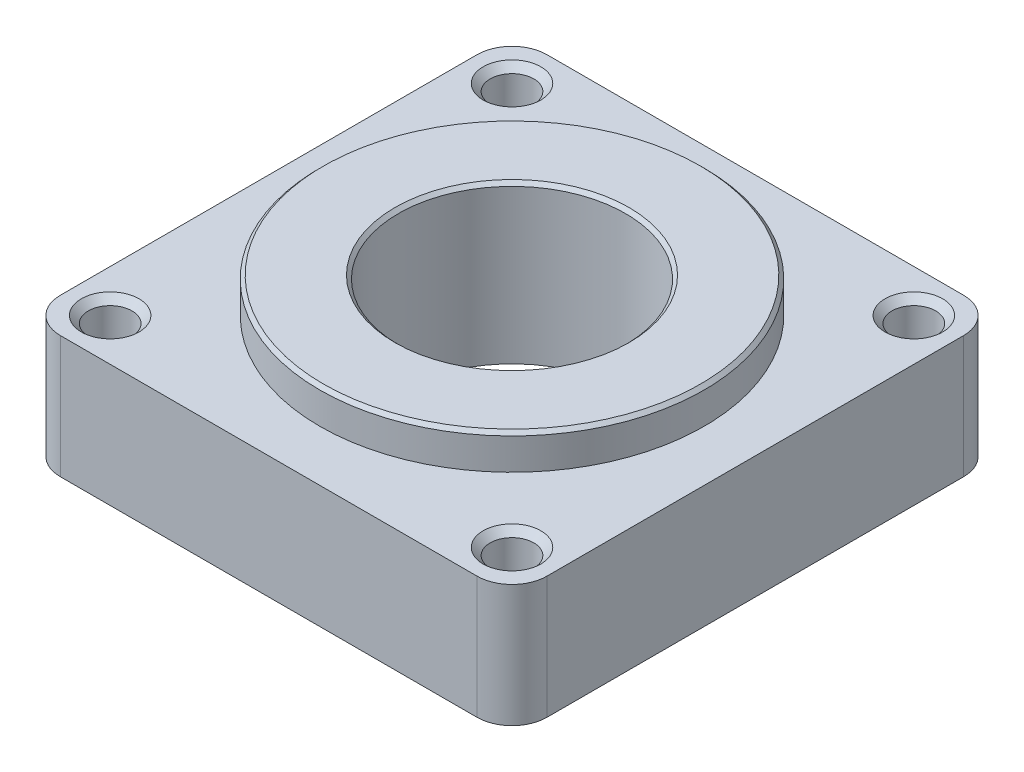
ISO-10303-21;
HEADER;
FILE_DESCRIPTION(('STEP AP214'),'2;1');
FILE_NAME('part.step','',(''),(''),'','','');
FILE_SCHEMA(('AUTOMOTIVE_DESIGN { 1 0 10303 214 1 1 1 1 }'));
ENDSEC;
DATA;
#1=APPLICATION_CONTEXT('core data for automotive mechanical design processes');
#2=APPLICATION_PROTOCOL_DEFINITION('international standard','automotive_design',2000,#1);
#3=PRODUCT_CONTEXT('',#1,'mechanical');
#4=PRODUCT('Part','Part','',(#3));
#5=PRODUCT_RELATED_PRODUCT_CATEGORY('part','',(#4));
#6=PRODUCT_DEFINITION_FORMATION('','',#4);
#7=PRODUCT_DEFINITION_CONTEXT('part definition',#1,'design');
#8=PRODUCT_DEFINITION('design','',#6,#7);
#9=PRODUCT_DEFINITION_SHAPE('','',#8);
#10=(LENGTH_UNIT() NAMED_UNIT(*) SI_UNIT(.MILLI.,.METRE.));
#11=(NAMED_UNIT(*) PLANE_ANGLE_UNIT() SI_UNIT($,.RADIAN.));
#12=(NAMED_UNIT(*) SI_UNIT($,.STERADIAN.) SOLID_ANGLE_UNIT());
#13=UNCERTAINTY_MEASURE_WITH_UNIT(LENGTH_MEASURE(1.E-05),#10,'distance_accuracy_value','');
#14=(GEOMETRIC_REPRESENTATION_CONTEXT(3) GLOBAL_UNCERTAINTY_ASSIGNED_CONTEXT((#13)) GLOBAL_UNIT_ASSIGNED_CONTEXT((#10,
#11,#12)) REPRESENTATION_CONTEXT('',''));
#15=CARTESIAN_POINT('',(0.,0.,0.));
#16=DIRECTION('',(0.,0.,1.));
#17=DIRECTION('',(1.,0.,0.));
#18=AXIS2_PLACEMENT_3D('',#15,#16,#17);
#19=CARTESIAN_POINT('',(0.,7.,0.));
#20=DIRECTION('',(0.,1.,0.));
#21=DIRECTION('',(0.,0.,1.));
#22=AXIS2_PLACEMENT_3D('',#19,#20,#21);
#23=PLANE('',#22);
#24=CARTESIAN_POINT('',(11.5,7.,-11.5));
#25=DIRECTION('',(0.,1.,0.));
#26=DIRECTION('',(0.,0.,1.));
#27=AXIS2_PLACEMENT_3D('',#24,#25,#26);
#28=CIRCLE('',#27,1.65);
#29=CARTESIAN_POINT('',(11.5,7.,-9.85));
#30=VERTEX_POINT('',#29);
#31=EDGE_CURVE('E203',#30,#30,#28,.F.);
#32=ORIENTED_EDGE('',*,*,#31,.T.);
#33=EDGE_LOOP('',(#32));
#34=FACE_BOUND('',#33,.T.);
#35=CARTESIAN_POINT('',(-11.5,7.,-11.5));
#36=DIRECTION('',(0.,1.,0.));
#37=DIRECTION('',(0.,0.,1.));
#38=AXIS2_PLACEMENT_3D('',#35,#36,#37);
#39=CIRCLE('',#38,1.65);
#40=CARTESIAN_POINT('',(-11.5,7.,-9.85));
#41=VERTEX_POINT('',#40);
#42=EDGE_CURVE('E200',#41,#41,#39,.F.);
#43=ORIENTED_EDGE('',*,*,#42,.T.);
#44=EDGE_LOOP('',(#43));
#45=FACE_BOUND('',#44,.T.);
#46=CARTESIAN_POINT('',(11.5,7.,11.5));
#47=DIRECTION('',(0.,1.,0.));
#48=DIRECTION('',(0.,0.,1.));
#49=AXIS2_PLACEMENT_3D('',#46,#47,#48);
#50=CIRCLE('',#49,1.65);
#51=CARTESIAN_POINT('',(11.5,7.,13.15));
#52=VERTEX_POINT('',#51);
#53=EDGE_CURVE('E197',#52,#52,#50,.F.);
#54=ORIENTED_EDGE('',*,*,#53,.T.);
#55=EDGE_LOOP('',(#54));
#56=FACE_BOUND('',#55,.T.);
#57=CARTESIAN_POINT('',(-11.5,7.,11.5));
#58=DIRECTION('',(0.,1.,0.));
#59=DIRECTION('',(0.,0.,1.));
#60=AXIS2_PLACEMENT_3D('',#57,#58,#59);
#61=CIRCLE('',#60,1.65);
#62=CARTESIAN_POINT('',(-11.5,7.,13.15));
#63=VERTEX_POINT('',#62);
#64=EDGE_CURVE('E194',#63,#63,#61,.F.);
#65=ORIENTED_EDGE('',*,*,#64,.T.);
#66=EDGE_LOOP('',(#65));
#67=FACE_BOUND('',#66,.T.);
#68=DIRECTION('',(0.,0.,1.));
#69=VECTOR('',#68,1.);
#70=CARTESIAN_POINT('',(-13.925,7.,0.));
#71=LINE('',#70,#69);
#72=CARTESIAN_POINT('',(-13.925,7.,-11.925));
#73=VERTEX_POINT('',#72);
#74=CARTESIAN_POINT('',(-13.925,7.,11.925));
#75=VERTEX_POINT('',#74);
#76=EDGE_CURVE('E162',#73,#75,#71,.T.);
#77=ORIENTED_EDGE('',*,*,#76,.T.);
#78=CARTESIAN_POINT('',(-11.925,7.,11.925));
#79=DIRECTION('',(0.,1.,0.));
#80=DIRECTION('',(0.,0.,1.));
#81=AXIS2_PLACEMENT_3D('',#78,#79,#80);
#82=CIRCLE('',#81,2.);
#83=CARTESIAN_POINT('',(-11.925,7.,13.925));
#84=VERTEX_POINT('',#83);
#85=EDGE_CURVE('E149',#75,#84,#82,.T.);
#86=ORIENTED_EDGE('',*,*,#85,.T.);
#87=DIRECTION('',(-1.,0.,0.));
#88=VECTOR('',#87,1.);
#89=CARTESIAN_POINT('',(0.,7.,13.925));
#90=LINE('',#89,#88);
#91=CARTESIAN_POINT('',(11.925,7.,13.925));
#92=VERTEX_POINT('',#91);
#93=EDGE_CURVE('E160',#92,#84,#90,.T.);
#94=ORIENTED_EDGE('',*,*,#93,.F.);
#95=CARTESIAN_POINT('',(11.925,7.,11.925));
#96=DIRECTION('',(0.,1.,0.));
#97=DIRECTION('',(0.,0.,1.));
#98=AXIS2_PLACEMENT_3D('',#95,#96,#97);
#99=CIRCLE('',#98,2.);
#100=CARTESIAN_POINT('',(13.925,7.,11.925));
#101=VERTEX_POINT('',#100);
#102=EDGE_CURVE('E126',#92,#101,#99,.T.);
#103=ORIENTED_EDGE('',*,*,#102,.T.);
#104=DIRECTION('',(0.,0.,1.));
#105=VECTOR('',#104,1.);
#106=CARTESIAN_POINT('',(13.925,7.,0.));
#107=LINE('',#106,#105);
#108=CARTESIAN_POINT('',(13.925,7.,-11.925));
#109=VERTEX_POINT('',#108);
#110=EDGE_CURVE('E158',#109,#101,#107,.T.);
#111=ORIENTED_EDGE('',*,*,#110,.F.);
#112=CARTESIAN_POINT('',(11.925,7.,-11.925));
#113=DIRECTION('',(0.,1.,0.));
#114=DIRECTION('',(0.,0.,1.));
#115=AXIS2_PLACEMENT_3D('',#112,#113,#114);
#116=CIRCLE('',#115,2.);
#117=CARTESIAN_POINT('',(11.925,7.,-13.925));
#118=VERTEX_POINT('',#117);
#119=EDGE_CURVE('E51',#109,#118,#116,.T.);
#120=ORIENTED_EDGE('',*,*,#119,.T.);
#121=DIRECTION('',(1.,0.,0.));
#122=VECTOR('',#121,1.);
#123=CARTESIAN_POINT('',(0.,7.,-13.925));
#124=LINE('',#123,#122);
#125=CARTESIAN_POINT('',(-11.925,7.,-13.925));
#126=VERTEX_POINT('',#125);
#127=EDGE_CURVE('E159',#126,#118,#124,.T.);
#128=ORIENTED_EDGE('',*,*,#127,.F.);
#129=CARTESIAN_POINT('',(-11.925,7.,-11.925));
#130=DIRECTION('',(0.,1.,0.));
#131=DIRECTION('',(0.,0.,1.));
#132=AXIS2_PLACEMENT_3D('',#129,#130,#131);
#133=CIRCLE('',#132,2.);
#134=EDGE_CURVE('E147',#126,#73,#133,.T.);
#135=ORIENTED_EDGE('',*,*,#134,.T.);
#136=EDGE_LOOP('',(#77,#86,#94,#103,#111,#120,#128,#135));
#137=FACE_BOUND('',#136,.T.);
#138=CARTESIAN_POINT('',(0.,7.,0.));
#139=DIRECTION('',(0.,1.,0.));
#140=DIRECTION('',(0.,0.,1.));
#141=AXIS2_PLACEMENT_3D('',#138,#139,#140);
#142=CIRCLE('',#141,11.);
#143=CARTESIAN_POINT('',(0.,7.,11.));
#144=VERTEX_POINT('',#143);
#145=EDGE_CURVE('E175',#144,#144,#142,.F.);
#146=ORIENTED_EDGE('',*,*,#145,.T.);
#147=EDGE_LOOP('',(#146));
#148=FACE_BOUND('',#147,.T.);
#149=ADVANCED_FACE('F36',(#34,#45,#56,#67,#137,#148),#23,.T.);
#150=CARTESIAN_POINT('',(0.,7.,13.925));
#151=DIRECTION('',(0.,0.,1.));
#152=DIRECTION('',(1.,0.,0.));
#153=AXIS2_PLACEMENT_3D('',#150,#151,#152);
#154=PLANE('',#153);
#155=ORIENTED_EDGE('',*,*,#93,.T.);
#156=DIRECTION('',(0.,-1.,0.));
#157=VECTOR('',#156,1.);
#158=CARTESIAN_POINT('',(-11.925,0.,13.925));
#159=LINE('',#158,#157);
#160=CARTESIAN_POINT('',(-11.925,0.,13.925));
#161=VERTEX_POINT('',#160);
#162=EDGE_CURVE('E114',#84,#161,#159,.T.);
#163=ORIENTED_EDGE('',*,*,#162,.T.);
#164=DIRECTION('',(-1.,0.,0.));
#165=VECTOR('',#164,1.);
#166=CARTESIAN_POINT('',(0.,0.,13.925));
#167=LINE('',#166,#165);
#168=CARTESIAN_POINT('',(11.925,0.,13.925));
#169=VERTEX_POINT('',#168);
#170=EDGE_CURVE('E106',#169,#161,#167,.T.);
#171=ORIENTED_EDGE('',*,*,#170,.F.);
#172=DIRECTION('',(0.,-1.,0.));
#173=VECTOR('',#172,1.);
#174=CARTESIAN_POINT('',(11.925,7.,13.925));
#175=LINE('',#174,#173);
#176=EDGE_CURVE('E120',#169,#92,#175,.F.);
#177=ORIENTED_EDGE('',*,*,#176,.T.);
#178=EDGE_LOOP('',(#155,#163,#171,#177));
#179=FACE_BOUND('',#178,.T.);
#180=ADVANCED_FACE('F119',(#179),#154,.T.);
#181=CARTESIAN_POINT('',(13.925,7.,0.));
#182=DIRECTION('',(1.,0.,0.));
#183=DIRECTION('',(0.,0.,-1.));
#184=AXIS2_PLACEMENT_3D('',#181,#182,#183);
#185=PLANE('',#184);
#186=DIRECTION('',(0.,0.,1.));
#187=VECTOR('',#186,1.);
#188=CARTESIAN_POINT('',(13.925,0.,0.));
#189=LINE('',#188,#187);
#190=CARTESIAN_POINT('',(13.925,0.,-11.925));
#191=VERTEX_POINT('',#190);
#192=CARTESIAN_POINT('',(13.925,0.,11.925));
#193=VERTEX_POINT('',#192);
#194=EDGE_CURVE('E108',#191,#193,#189,.T.);
#195=ORIENTED_EDGE('',*,*,#194,.F.);
#196=DIRECTION('',(0.,-1.,0.));
#197=VECTOR('',#196,1.);
#198=CARTESIAN_POINT('',(13.925,7.,-11.925));
#199=LINE('',#198,#197);
#200=EDGE_CURVE('E11',#191,#109,#199,.F.);
#201=ORIENTED_EDGE('',*,*,#200,.T.);
#202=ORIENTED_EDGE('',*,*,#110,.T.);
#203=DIRECTION('',(0.,-1.,0.));
#204=VECTOR('',#203,1.);
#205=CARTESIAN_POINT('',(13.925,7.,11.925));
#206=LINE('',#205,#204);
#207=EDGE_CURVE('E44',#101,#193,#206,.T.);
#208=ORIENTED_EDGE('',*,*,#207,.T.);
#209=EDGE_LOOP('',(#195,#201,#202,#208));
#210=FACE_BOUND('',#209,.T.);
#211=ADVANCED_FACE('F156',(#210),#185,.T.);
#212=CARTESIAN_POINT('',(0.,7.,-13.925));
#213=DIRECTION('',(0.,0.,-1.));
#214=DIRECTION('',(-1.,0.,0.));
#215=AXIS2_PLACEMENT_3D('',#212,#213,#214);
#216=PLANE('',#215);
#217=DIRECTION('',(1.,0.,0.));
#218=VECTOR('',#217,1.);
#219=CARTESIAN_POINT('',(0.,0.,-13.925));
#220=LINE('',#219,#218);
#221=CARTESIAN_POINT('',(-11.925,0.,-13.925));
#222=VERTEX_POINT('',#221);
#223=CARTESIAN_POINT('',(11.925,0.,-13.925));
#224=VERTEX_POINT('',#223);
#225=EDGE_CURVE('E184',#222,#224,#220,.T.);
#226=ORIENTED_EDGE('',*,*,#225,.F.);
#227=DIRECTION('',(0.,-1.,0.));
#228=VECTOR('',#227,1.);
#229=CARTESIAN_POINT('',(-11.925,7.,-13.925));
#230=LINE('',#229,#228);
#231=EDGE_CURVE('E58',#222,#126,#230,.F.);
#232=ORIENTED_EDGE('',*,*,#231,.T.);
#233=ORIENTED_EDGE('',*,*,#127,.T.);
#234=DIRECTION('',(0.,-1.,0.));
#235=VECTOR('',#234,1.);
#236=CARTESIAN_POINT('',(11.925,7.,-13.925));
#237=LINE('',#236,#235);
#238=EDGE_CURVE('E151',#118,#224,#237,.T.);
#239=ORIENTED_EDGE('',*,*,#238,.T.);
#240=EDGE_LOOP('',(#226,#232,#233,#239));
#241=FACE_BOUND('',#240,.T.);
#242=ADVANCED_FACE('F300',(#241),#216,.T.);
#243=CARTESIAN_POINT('',(-13.925,7.,0.));
#244=DIRECTION('',(1.,0.,0.));
#245=DIRECTION('',(0.,0.,-1.));
#246=AXIS2_PLACEMENT_3D('',#243,#244,#245);
#247=PLANE('',#246);
#248=DIRECTION('',(0.,0.,1.));
#249=VECTOR('',#248,1.);
#250=CARTESIAN_POINT('',(-13.925,0.,0.));
#251=LINE('',#250,#249);
#252=CARTESIAN_POINT('',(-13.925,0.,-11.925));
#253=VERTEX_POINT('',#252);
#254=CARTESIAN_POINT('',(-13.925,0.,11.925));
#255=VERTEX_POINT('',#254);
#256=EDGE_CURVE('E187',#253,#255,#251,.T.);
#257=ORIENTED_EDGE('',*,*,#256,.T.);
#258=DIRECTION('',(0.,-1.,0.));
#259=VECTOR('',#258,1.);
#260=CARTESIAN_POINT('',(-13.925,7.,11.925));
#261=LINE('',#260,#259);
#262=EDGE_CURVE('E143',#255,#75,#261,.F.);
#263=ORIENTED_EDGE('',*,*,#262,.T.);
#264=ORIENTED_EDGE('',*,*,#76,.F.);
#265=DIRECTION('',(0.,-1.,0.));
#266=VECTOR('',#265,1.);
#267=CARTESIAN_POINT('',(-13.925,0.,-11.925));
#268=LINE('',#267,#266);
#269=EDGE_CURVE('E140',#73,#253,#268,.T.);
#270=ORIENTED_EDGE('',*,*,#269,.T.);
#271=EDGE_LOOP('',(#257,#263,#264,#270));
#272=FACE_BOUND('',#271,.T.);
#273=ADVANCED_FACE('F306',(#272),#247,.F.);
#274=CARTESIAN_POINT('',(-11.5,7.,-11.5));
#275=DIRECTION('',(0.,-1.,0.));
#276=DIRECTION('',(0.,0.,-1.));
#277=AXIS2_PLACEMENT_3D('',#274,#275,#276);
#278=CYLINDRICAL_SURFACE('',#277,1.25);
#279=CARTESIAN_POINT('',(-11.5,6.6,-11.5));
#280=DIRECTION('',(0.,1.,0.));
#281=DIRECTION('',(0.,0.,1.));
#282=AXIS2_PLACEMENT_3D('',#279,#280,#281);
#283=CIRCLE('',#282,1.25);
#284=CARTESIAN_POINT('',(-11.5,6.6,-10.25));
#285=VERTEX_POINT('',#284);
#286=EDGE_CURVE('E206',#285,#285,#283,.T.);
#287=ORIENTED_EDGE('',*,*,#286,.T.);
#288=EDGE_LOOP('',(#287));
#289=FACE_BOUND('',#288,.T.);
#290=CARTESIAN_POINT('',(-11.5,0.,-11.5));
#291=DIRECTION('',(0.,1.,0.));
#292=DIRECTION('',(0.,0.,1.));
#293=AXIS2_PLACEMENT_3D('',#290,#291,#292);
#294=CIRCLE('',#293,1.25);
#295=CARTESIAN_POINT('',(-11.5,0.,-10.25));
#296=VERTEX_POINT('',#295);
#297=EDGE_CURVE('E123',#296,#296,#294,.T.);
#298=ORIENTED_EDGE('',*,*,#297,.F.);
#299=EDGE_LOOP('',(#298));
#300=FACE_BOUND('',#299,.T.);
#301=ADVANCED_FACE('F314',(#289,#300),#278,.F.);
#302=CARTESIAN_POINT('',(11.5,7.,-11.5));
#303=DIRECTION('',(0.,-1.,0.));
#304=DIRECTION('',(0.,0.,-1.));
#305=AXIS2_PLACEMENT_3D('',#302,#303,#304);
#306=CYLINDRICAL_SURFACE('',#305,1.25);
#307=CARTESIAN_POINT('',(11.5,6.6,-11.5));
#308=DIRECTION('',(0.,1.,0.));
#309=DIRECTION('',(0.,0.,1.));
#310=AXIS2_PLACEMENT_3D('',#307,#308,#309);
#311=CIRCLE('',#310,1.25);
#312=CARTESIAN_POINT('',(11.5,6.6,-10.25));
#313=VERTEX_POINT('',#312);
#314=EDGE_CURVE('E170',#313,#313,#311,.T.);
#315=ORIENTED_EDGE('',*,*,#314,.T.);
#316=EDGE_LOOP('',(#315));
#317=FACE_BOUND('',#316,.T.);
#318=CARTESIAN_POINT('',(11.5,0.,-11.5));
#319=DIRECTION('',(0.,1.,0.));
#320=DIRECTION('',(0.,0.,1.));
#321=AXIS2_PLACEMENT_3D('',#318,#319,#320);
#322=CIRCLE('',#321,1.25);
#323=CARTESIAN_POINT('',(11.5,0.,-10.25));
#324=VERTEX_POINT('',#323);
#325=EDGE_CURVE('E178',#324,#324,#322,.T.);
#326=ORIENTED_EDGE('',*,*,#325,.F.);
#327=EDGE_LOOP('',(#326));
#328=FACE_BOUND('',#327,.T.);
#329=ADVANCED_FACE('F320',(#317,#328),#306,.F.);
#330=CARTESIAN_POINT('',(-11.5,7.,11.5));
#331=DIRECTION('',(0.,-1.,0.));
#332=DIRECTION('',(0.,0.,-1.));
#333=AXIS2_PLACEMENT_3D('',#330,#331,#332);
#334=CYLINDRICAL_SURFACE('',#333,1.25);
#335=CARTESIAN_POINT('',(-11.5,6.6,11.5));
#336=DIRECTION('',(0.,1.,0.));
#337=DIRECTION('',(0.,0.,1.));
#338=AXIS2_PLACEMENT_3D('',#335,#336,#337);
#339=CIRCLE('',#338,1.25);
#340=CARTESIAN_POINT('',(-11.5,6.6,12.75));
#341=VERTEX_POINT('',#340);
#342=EDGE_CURVE('E212',#341,#341,#339,.T.);
#343=ORIENTED_EDGE('',*,*,#342,.T.);
#344=EDGE_LOOP('',(#343));
#345=FACE_BOUND('',#344,.T.);
#346=CARTESIAN_POINT('',(-11.5,0.,11.5));
#347=DIRECTION('',(0.,1.,0.));
#348=DIRECTION('',(0.,0.,1.));
#349=AXIS2_PLACEMENT_3D('',#346,#347,#348);
#350=CIRCLE('',#349,1.25);
#351=CARTESIAN_POINT('',(-11.5,0.,12.75));
#352=VERTEX_POINT('',#351);
#353=EDGE_CURVE('E174',#352,#352,#350,.T.);
#354=ORIENTED_EDGE('',*,*,#353,.F.);
#355=EDGE_LOOP('',(#354));
#356=FACE_BOUND('',#355,.T.);
#357=ADVANCED_FACE('F328',(#345,#356),#334,.F.);
#358=CARTESIAN_POINT('',(11.5,7.,11.5));
#359=DIRECTION('',(0.,-1.,0.));
#360=DIRECTION('',(0.,0.,-1.));
#361=AXIS2_PLACEMENT_3D('',#358,#359,#360);
#362=CYLINDRICAL_SURFACE('',#361,1.25);
#363=CARTESIAN_POINT('',(11.5,6.6,11.5));
#364=DIRECTION('',(0.,1.,0.));
#365=DIRECTION('',(0.,0.,1.));
#366=AXIS2_PLACEMENT_3D('',#363,#364,#365);
#367=CIRCLE('',#366,1.25);
#368=CARTESIAN_POINT('',(11.5,6.6,12.75));
#369=VERTEX_POINT('',#368);
#370=EDGE_CURVE('E209',#369,#369,#367,.T.);
#371=ORIENTED_EDGE('',*,*,#370,.T.);
#372=EDGE_LOOP('',(#371));
#373=FACE_BOUND('',#372,.T.);
#374=CARTESIAN_POINT('',(11.5,0.,11.5));
#375=DIRECTION('',(0.,1.,0.));
#376=DIRECTION('',(0.,0.,1.));
#377=AXIS2_PLACEMENT_3D('',#374,#375,#376);
#378=CIRCLE('',#377,1.25);
#379=CARTESIAN_POINT('',(11.5,0.,12.75));
#380=VERTEX_POINT('',#379);
#381=EDGE_CURVE('E171',#380,#380,#378,.T.);
#382=ORIENTED_EDGE('',*,*,#381,.F.);
#383=EDGE_LOOP('',(#382));
#384=FACE_BOUND('',#383,.T.);
#385=ADVANCED_FACE('F237',(#373,#384),#362,.F.);
#386=CARTESIAN_POINT('',(0.,7.,0.));
#387=DIRECTION('',(0.,-1.,0.));
#388=DIRECTION('',(0.,0.,-1.));
#389=AXIS2_PLACEMENT_3D('',#386,#387,#388);
#390=CYLINDRICAL_SURFACE('',#389,6.5);
#391=CARTESIAN_POINT('',(0.,8.79999999999999,0.));
#392=DIRECTION('',(0.,1.,0.));
#393=DIRECTION('',(0.,0.,1.));
#394=AXIS2_PLACEMENT_3D('',#391,#392,#393);
#395=CIRCLE('',#394,6.5);
#396=CARTESIAN_POINT('',(0.,8.79999999999999,6.5));
#397=VERTEX_POINT('',#396);
#398=EDGE_CURVE('E215',#397,#397,#395,.T.);
#399=ORIENTED_EDGE('',*,*,#398,.T.);
#400=EDGE_LOOP('',(#399));
#401=FACE_BOUND('',#400,.T.);
#402=CARTESIAN_POINT('',(0.,0.,0.));
#403=DIRECTION('',(0.,1.,0.));
#404=DIRECTION('',(0.,0.,1.));
#405=AXIS2_PLACEMENT_3D('',#402,#403,#404);
#406=CIRCLE('',#405,6.5);
#407=CARTESIAN_POINT('',(0.,0.,6.5));
#408=VERTEX_POINT('',#407);
#409=EDGE_CURVE('E164',#408,#408,#406,.T.);
#410=ORIENTED_EDGE('',*,*,#409,.F.);
#411=EDGE_LOOP('',(#410));
#412=FACE_BOUND('',#411,.T.);
#413=ADVANCED_FACE('F234',(#401,#412),#390,.F.);
#414=CARTESIAN_POINT('',(0.,0.,0.));
#415=DIRECTION('',(0.,1.,0.));
#416=DIRECTION('',(0.,0.,1.));
#417=AXIS2_PLACEMENT_3D('',#414,#415,#416);
#418=PLANE('',#417);
#419=ORIENTED_EDGE('',*,*,#409,.T.);
#420=EDGE_LOOP('',(#419));
#421=FACE_BOUND('',#420,.T.);
#422=ORIENTED_EDGE('',*,*,#170,.T.);
#423=CARTESIAN_POINT('',(-11.925,0.,11.925));
#424=DIRECTION('',(0.,1.,0.));
#425=DIRECTION('',(0.,0.,1.));
#426=AXIS2_PLACEMENT_3D('',#423,#424,#425);
#427=CIRCLE('',#426,2.);
#428=EDGE_CURVE('E138',#161,#255,#427,.F.);
#429=ORIENTED_EDGE('',*,*,#428,.T.);
#430=ORIENTED_EDGE('',*,*,#256,.F.);
#431=CARTESIAN_POINT('',(-11.925,0.,-11.925));
#432=DIRECTION('',(0.,1.,0.));
#433=DIRECTION('',(0.,0.,1.));
#434=AXIS2_PLACEMENT_3D('',#431,#432,#433);
#435=CIRCLE('',#434,2.);
#436=EDGE_CURVE('E136',#253,#222,#435,.F.);
#437=ORIENTED_EDGE('',*,*,#436,.T.);
#438=ORIENTED_EDGE('',*,*,#225,.T.);
#439=CARTESIAN_POINT('',(11.925,0.,-11.925));
#440=DIRECTION('',(0.,1.,0.));
#441=DIRECTION('',(0.,0.,1.));
#442=AXIS2_PLACEMENT_3D('',#439,#440,#441);
#443=CIRCLE('',#442,2.);
#444=EDGE_CURVE('E113',#224,#191,#443,.F.);
#445=ORIENTED_EDGE('',*,*,#444,.T.);
#446=ORIENTED_EDGE('',*,*,#194,.T.);
#447=CARTESIAN_POINT('',(11.925,0.,11.925));
#448=DIRECTION('',(0.,1.,0.));
#449=DIRECTION('',(0.,0.,1.));
#450=AXIS2_PLACEMENT_3D('',#447,#448,#449);
#451=CIRCLE('',#450,2.);
#452=EDGE_CURVE('E102',#193,#169,#451,.F.);
#453=ORIENTED_EDGE('',*,*,#452,.T.);
#454=EDGE_LOOP('',(#422,#429,#430,#437,#438,#445,#446,#453));
#455=FACE_BOUND('',#454,.T.);
#456=ORIENTED_EDGE('',*,*,#297,.T.);
#457=EDGE_LOOP('',(#456));
#458=FACE_BOUND('',#457,.T.);
#459=ORIENTED_EDGE('',*,*,#325,.T.);
#460=EDGE_LOOP('',(#459));
#461=FACE_BOUND('',#460,.T.);
#462=ORIENTED_EDGE('',*,*,#353,.T.);
#463=EDGE_LOOP('',(#462));
#464=FACE_BOUND('',#463,.T.);
#465=ORIENTED_EDGE('',*,*,#381,.T.);
#466=EDGE_LOOP('',(#465));
#467=FACE_BOUND('',#466,.T.);
#468=ADVANCED_FACE('F104',(#421,#455,#458,#461,#464,#467),#418,.F.);
#469=CARTESIAN_POINT('',(0.,9.,0.));
#470=DIRECTION('',(0.,-1.,0.));
#471=DIRECTION('',(0.,0.,-1.));
#472=AXIS2_PLACEMENT_3D('',#469,#470,#471);
#473=CYLINDRICAL_SURFACE('',#472,11.);
#474=CARTESIAN_POINT('',(0.,8.8,0.));
#475=DIRECTION('',(0.,1.,0.));
#476=DIRECTION('',(0.,0.,1.));
#477=AXIS2_PLACEMENT_3D('',#474,#475,#476);
#478=CIRCLE('',#477,11.);
#479=CARTESIAN_POINT('',(0.,8.8,11.));
#480=VERTEX_POINT('',#479);
#481=EDGE_CURVE('E127',#480,#480,#478,.F.);
#482=ORIENTED_EDGE('',*,*,#481,.T.);
#483=EDGE_LOOP('',(#482));
#484=FACE_BOUND('',#483,.T.);
#485=ORIENTED_EDGE('',*,*,#145,.F.);
#486=EDGE_LOOP('',(#485));
#487=FACE_BOUND('',#486,.T.);
#488=ADVANCED_FACE('F242',(#484,#487),#473,.T.);
#489=CARTESIAN_POINT('',(0.,9.,0.));
#490=DIRECTION('',(0.,1.,0.));
#491=DIRECTION('',(0.,0.,1.));
#492=AXIS2_PLACEMENT_3D('',#489,#490,#491);
#493=PLANE('',#492);
#494=CARTESIAN_POINT('',(0.,9.,0.));
#495=DIRECTION('',(0.,1.,0.));
#496=DIRECTION('',(0.,0.,1.));
#497=AXIS2_PLACEMENT_3D('',#494,#495,#496);
#498=CIRCLE('',#497,6.7);
#499=CARTESIAN_POINT('',(0.,9.,6.7));
#500=VERTEX_POINT('',#499);
#501=EDGE_CURVE('E131',#500,#500,#498,.F.);
#502=ORIENTED_EDGE('',*,*,#501,.T.);
#503=EDGE_LOOP('',(#502));
#504=FACE_BOUND('',#503,.T.);
#505=CARTESIAN_POINT('',(0.,9.,0.));
#506=DIRECTION('',(0.,1.,0.));
#507=DIRECTION('',(0.,0.,1.));
#508=AXIS2_PLACEMENT_3D('',#505,#506,#507);
#509=CIRCLE('',#508,10.8);
#510=CARTESIAN_POINT('',(0.,9.,10.8));
#511=VERTEX_POINT('',#510);
#512=EDGE_CURVE('E218',#511,#511,#509,.T.);
#513=ORIENTED_EDGE('',*,*,#512,.T.);
#514=EDGE_LOOP('',(#513));
#515=FACE_BOUND('',#514,.T.);
#516=ADVANCED_FACE('F223',(#504,#515),#493,.T.);
#517=CARTESIAN_POINT('',(11.5,6.6,-11.5));
#518=DIRECTION('',(0.,1.,0.));
#519=DIRECTION('',(0.,0.,1.));
#520=AXIS2_PLACEMENT_3D('',#517,#518,#519);
#521=CONICAL_SURFACE('',#520,1.25,0.785398163397453);
#522=ORIENTED_EDGE('',*,*,#31,.F.);
#523=EDGE_LOOP('',(#522));
#524=FACE_BOUND('',#523,.T.);
#525=ORIENTED_EDGE('',*,*,#314,.F.);
#526=EDGE_LOOP('',(#525));
#527=FACE_BOUND('',#526,.T.);
#528=ADVANCED_FACE('F259',(#524,#527),#521,.F.);
#529=CARTESIAN_POINT('',(-11.5,6.6,-11.5));
#530=DIRECTION('',(0.,1.,0.));
#531=DIRECTION('',(0.,0.,1.));
#532=AXIS2_PLACEMENT_3D('',#529,#530,#531);
#533=CONICAL_SURFACE('',#532,1.25,0.785398163397453);
#534=ORIENTED_EDGE('',*,*,#42,.F.);
#535=EDGE_LOOP('',(#534));
#536=FACE_BOUND('',#535,.T.);
#537=ORIENTED_EDGE('',*,*,#286,.F.);
#538=EDGE_LOOP('',(#537));
#539=FACE_BOUND('',#538,.T.);
#540=ADVANCED_FACE('F263',(#536,#539),#533,.F.);
#541=CARTESIAN_POINT('',(11.5,6.6,11.5));
#542=DIRECTION('',(0.,1.,0.));
#543=DIRECTION('',(0.,0.,1.));
#544=AXIS2_PLACEMENT_3D('',#541,#542,#543);
#545=CONICAL_SURFACE('',#544,1.25,0.785398163397453);
#546=ORIENTED_EDGE('',*,*,#53,.F.);
#547=EDGE_LOOP('',(#546));
#548=FACE_BOUND('',#547,.T.);
#549=ORIENTED_EDGE('',*,*,#370,.F.);
#550=EDGE_LOOP('',(#549));
#551=FACE_BOUND('',#550,.T.);
#552=ADVANCED_FACE('F269',(#548,#551),#545,.F.);
#553=CARTESIAN_POINT('',(-11.5,6.6,11.5));
#554=DIRECTION('',(0.,1.,0.));
#555=DIRECTION('',(0.,0.,1.));
#556=AXIS2_PLACEMENT_3D('',#553,#554,#555);
#557=CONICAL_SURFACE('',#556,1.25,0.785398163397453);
#558=ORIENTED_EDGE('',*,*,#64,.F.);
#559=EDGE_LOOP('',(#558));
#560=FACE_BOUND('',#559,.T.);
#561=ORIENTED_EDGE('',*,*,#342,.F.);
#562=EDGE_LOOP('',(#561));
#563=FACE_BOUND('',#562,.T.);
#564=ADVANCED_FACE('F230',(#560,#563),#557,.F.);
#565=CARTESIAN_POINT('',(0.,8.79999999999999,0.));
#566=DIRECTION('',(0.,1.,0.));
#567=DIRECTION('',(0.,0.,1.));
#568=AXIS2_PLACEMENT_3D('',#565,#566,#567);
#569=CONICAL_SURFACE('',#568,6.5,0.785398163397435);
#570=ORIENTED_EDGE('',*,*,#501,.F.);
#571=EDGE_LOOP('',(#570));
#572=FACE_BOUND('',#571,.T.);
#573=ORIENTED_EDGE('',*,*,#398,.F.);
#574=EDGE_LOOP('',(#573));
#575=FACE_BOUND('',#574,.T.);
#576=ADVANCED_FACE('F226',(#572,#575),#569,.F.);
#577=CARTESIAN_POINT('',(0.,9.,0.));
#578=DIRECTION('',(0.,-1.,0.));
#579=DIRECTION('',(0.,0.,-1.));
#580=AXIS2_PLACEMENT_3D('',#577,#578,#579);
#581=CONICAL_SURFACE('',#580,10.8,0.785398163397448);
#582=ORIENTED_EDGE('',*,*,#481,.F.);
#583=EDGE_LOOP('',(#582));
#584=FACE_BOUND('',#583,.T.);
#585=ORIENTED_EDGE('',*,*,#512,.F.);
#586=EDGE_LOOP('',(#585));
#587=FACE_BOUND('',#586,.T.);
#588=ADVANCED_FACE('F229',(#584,#587),#581,.T.);
#589=CARTESIAN_POINT('',(-11.925,7.,11.925));
#590=DIRECTION('',(0.,1.,0.));
#591=DIRECTION('',(0.,0.,1.));
#592=AXIS2_PLACEMENT_3D('',#589,#590,#591);
#593=CYLINDRICAL_SURFACE('',#592,2.);
#594=ORIENTED_EDGE('',*,*,#85,.F.);
#595=ORIENTED_EDGE('',*,*,#262,.F.);
#596=ORIENTED_EDGE('',*,*,#428,.F.);
#597=ORIENTED_EDGE('',*,*,#162,.F.);
#598=EDGE_LOOP('',(#594,#595,#596,#597));
#599=FACE_BOUND('',#598,.T.);
#600=ADVANCED_FACE('F285',(#599),#593,.T.);
#601=CARTESIAN_POINT('',(-11.925,7.,-11.925));
#602=DIRECTION('',(0.,1.,0.));
#603=DIRECTION('',(0.,0.,1.));
#604=AXIS2_PLACEMENT_3D('',#601,#602,#603);
#605=CYLINDRICAL_SURFACE('',#604,2.);
#606=ORIENTED_EDGE('',*,*,#134,.F.);
#607=ORIENTED_EDGE('',*,*,#231,.F.);
#608=ORIENTED_EDGE('',*,*,#436,.F.);
#609=ORIENTED_EDGE('',*,*,#269,.F.);
#610=EDGE_LOOP('',(#606,#607,#608,#609));
#611=FACE_BOUND('',#610,.T.);
#612=ADVANCED_FACE('F289',(#611),#605,.T.);
#613=CARTESIAN_POINT('',(11.925,7.,-11.925));
#614=DIRECTION('',(0.,-1.,0.));
#615=DIRECTION('',(0.,0.,-1.));
#616=AXIS2_PLACEMENT_3D('',#613,#614,#615);
#617=CYLINDRICAL_SURFACE('',#616,2.);
#618=ORIENTED_EDGE('',*,*,#119,.F.);
#619=ORIENTED_EDGE('',*,*,#200,.F.);
#620=ORIENTED_EDGE('',*,*,#444,.F.);
#621=ORIENTED_EDGE('',*,*,#238,.F.);
#622=EDGE_LOOP('',(#618,#619,#620,#621));
#623=FACE_BOUND('',#622,.T.);
#624=ADVANCED_FACE('F292',(#623),#617,.T.);
#625=CARTESIAN_POINT('',(11.925,7.,11.925));
#626=DIRECTION('',(0.,-1.,0.));
#627=DIRECTION('',(0.,0.,-1.));
#628=AXIS2_PLACEMENT_3D('',#625,#626,#627);
#629=CYLINDRICAL_SURFACE('',#628,2.);
#630=ORIENTED_EDGE('',*,*,#102,.F.);
#631=ORIENTED_EDGE('',*,*,#176,.F.);
#632=ORIENTED_EDGE('',*,*,#452,.F.);
#633=ORIENTED_EDGE('',*,*,#207,.F.);
#634=EDGE_LOOP('',(#630,#631,#632,#633));
#635=FACE_BOUND('',#634,.T.);
#636=ADVANCED_FACE('F38',(#635),#629,.T.);
#637=CLOSED_SHELL('',(#149,#180,#211,#242,#273,#301,#329,#357,#385,#413,#468,#488,#516,#528,
#540,#552,#564,#576,#588,#600,#612,#624,#636));
#638=MANIFOLD_SOLID_BREP('B2',#637);
#639=ADVANCED_BREP_SHAPE_REPRESENTATION('',(#18,#638),#14);
#640=SHAPE_DEFINITION_REPRESENTATION(#9,#639);
ENDSEC;
END-ISO-10303-21;
